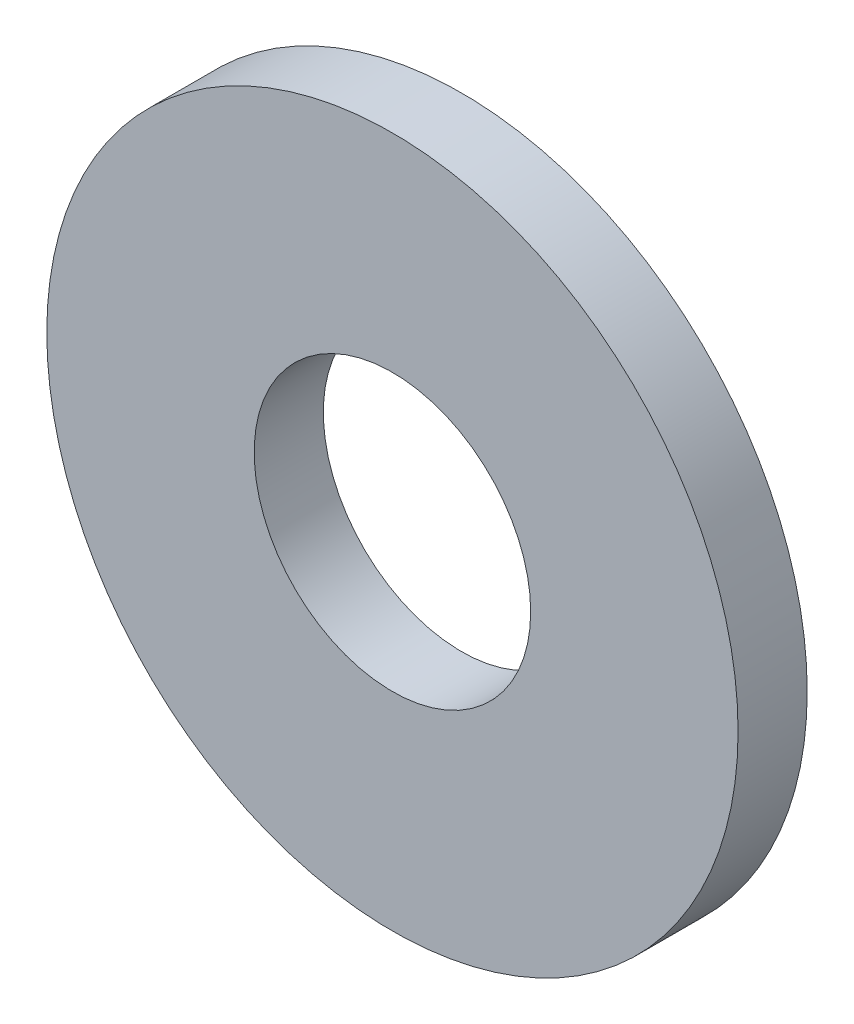
ISO-10303-21;
HEADER;
FILE_DESCRIPTION(('STEP AP214'),'2;1');
FILE_NAME('part.step','',(''),(''),'','','');
FILE_SCHEMA(('AUTOMOTIVE_DESIGN { 1 0 10303 214 1 1 1 1 }'));
ENDSEC;
DATA;
#1=APPLICATION_CONTEXT('core data for automotive mechanical design processes');
#2=APPLICATION_PROTOCOL_DEFINITION('international standard','automotive_design',2000,#1);
#3=PRODUCT_CONTEXT('',#1,'mechanical');
#4=PRODUCT('Part','Part','',(#3));
#5=PRODUCT_RELATED_PRODUCT_CATEGORY('part','',(#4));
#6=PRODUCT_DEFINITION_FORMATION('','',#4);
#7=PRODUCT_DEFINITION_CONTEXT('part definition',#1,'design');
#8=PRODUCT_DEFINITION('design','',#6,#7);
#9=PRODUCT_DEFINITION_SHAPE('','',#8);
#10=(LENGTH_UNIT() NAMED_UNIT(*) SI_UNIT(.MILLI.,.METRE.));
#11=(NAMED_UNIT(*) PLANE_ANGLE_UNIT() SI_UNIT($,.RADIAN.));
#12=(NAMED_UNIT(*) SI_UNIT($,.STERADIAN.) SOLID_ANGLE_UNIT());
#13=UNCERTAINTY_MEASURE_WITH_UNIT(LENGTH_MEASURE(1.E-05),#10,'distance_accuracy_value','');
#14=(GEOMETRIC_REPRESENTATION_CONTEXT(3) GLOBAL_UNCERTAINTY_ASSIGNED_CONTEXT((#13)) GLOBAL_UNIT_ASSIGNED_CONTEXT((#10,
#11,#12)) REPRESENTATION_CONTEXT('',''));
#15=CARTESIAN_POINT('',(0.,0.,0.));
#16=DIRECTION('',(0.,0.,1.));
#17=DIRECTION('',(1.,0.,0.));
#18=AXIS2_PLACEMENT_3D('',#15,#16,#17);
#19=CARTESIAN_POINT('',(0.,0.,0.25));
#20=DIRECTION('',(0.,0.,1.));
#21=DIRECTION('',(1.,0.,0.));
#22=AXIS2_PLACEMENT_3D('',#19,#20,#21);
#23=PLANE('',#22);
#24=CARTESIAN_POINT('',(0.,0.,0.25));
#25=DIRECTION('',(0.,0.,1.));
#26=DIRECTION('',(1.,0.,0.));
#27=AXIS2_PLACEMENT_3D('',#24,#25,#26);
#28=CIRCLE('',#27,2.5);
#29=CARTESIAN_POINT('',(2.5,0.,0.25));
#30=VERTEX_POINT('',#29);
#31=EDGE_CURVE('E10',#30,#30,#28,.T.);
#32=ORIENTED_EDGE('',*,*,#31,.T.);
#33=EDGE_LOOP('',(#32));
#34=FACE_BOUND('',#33,.T.);
#35=CARTESIAN_POINT('',(0.,0.,0.25));
#36=DIRECTION('',(0.,0.,1.));
#37=DIRECTION('',(1.,0.,0.));
#38=AXIS2_PLACEMENT_3D('',#35,#36,#37);
#39=CIRCLE('',#38,1.);
#40=CARTESIAN_POINT('',(1.,0.,0.25));
#41=VERTEX_POINT('',#40);
#42=EDGE_CURVE('E41',#41,#41,#39,.T.);
#43=ORIENTED_EDGE('',*,*,#42,.F.);
#44=EDGE_LOOP('',(#43));
#45=FACE_BOUND('',#44,.T.);
#46=ADVANCED_FACE('F30',(#34,#45),#23,.T.);
#47=CARTESIAN_POINT('',(0.,0.,-0.25));
#48=DIRECTION('',(0.,0.,1.));
#49=DIRECTION('',(1.,0.,0.));
#50=AXIS2_PLACEMENT_3D('',#47,#48,#49);
#51=PLANE('',#50);
#52=CARTESIAN_POINT('',(0.,0.,-0.25));
#53=DIRECTION('',(0.,0.,1.));
#54=DIRECTION('',(1.,0.,0.));
#55=AXIS2_PLACEMENT_3D('',#52,#53,#54);
#56=CIRCLE('',#55,2.5);
#57=CARTESIAN_POINT('',(2.5,0.,-0.25));
#58=VERTEX_POINT('',#57);
#59=EDGE_CURVE('E34',#58,#58,#56,.T.);
#60=ORIENTED_EDGE('',*,*,#59,.F.);
#61=EDGE_LOOP('',(#60));
#62=FACE_BOUND('',#61,.T.);
#63=CARTESIAN_POINT('',(0.,0.,-0.25));
#64=DIRECTION('',(0.,0.,1.));
#65=DIRECTION('',(1.,0.,0.));
#66=AXIS2_PLACEMENT_3D('',#63,#64,#65);
#67=CIRCLE('',#66,1.);
#68=CARTESIAN_POINT('',(1.,0.,-0.25));
#69=VERTEX_POINT('',#68);
#70=EDGE_CURVE('E43',#69,#69,#67,.T.);
#71=ORIENTED_EDGE('',*,*,#70,.T.);
#72=EDGE_LOOP('',(#71));
#73=FACE_BOUND('',#72,.T.);
#74=ADVANCED_FACE('F53',(#62,#73),#51,.F.);
#75=CARTESIAN_POINT('',(0.,0.,0.25));
#76=DIRECTION('',(0.,0.,-1.));
#77=DIRECTION('',(-1.,0.,0.));
#78=AXIS2_PLACEMENT_3D('',#75,#76,#77);
#79=CYLINDRICAL_SURFACE('',#78,2.5);
#80=ORIENTED_EDGE('',*,*,#31,.F.);
#81=EDGE_LOOP('',(#80));
#82=FACE_BOUND('',#81,.T.);
#83=ORIENTED_EDGE('',*,*,#59,.T.);
#84=EDGE_LOOP('',(#83));
#85=FACE_BOUND('',#84,.T.);
#86=ADVANCED_FACE('F32',(#82,#85),#79,.T.);
#87=CARTESIAN_POINT('',(0.,0.,0.25));
#88=DIRECTION('',(0.,0.,-1.));
#89=DIRECTION('',(-1.,0.,0.));
#90=AXIS2_PLACEMENT_3D('',#87,#88,#89);
#91=CYLINDRICAL_SURFACE('',#90,1.);
#92=ORIENTED_EDGE('',*,*,#42,.T.);
#93=EDGE_LOOP('',(#92));
#94=FACE_BOUND('',#93,.T.);
#95=ORIENTED_EDGE('',*,*,#70,.F.);
#96=EDGE_LOOP('',(#95));
#97=FACE_BOUND('',#96,.T.);
#98=ADVANCED_FACE('F49',(#94,#97),#91,.F.);
#99=CLOSED_SHELL('',(#46,#74,#86,#98));
#100=MANIFOLD_SOLID_BREP('B2',#99);
#101=ADVANCED_BREP_SHAPE_REPRESENTATION('',(#18,#100),#14);
#102=SHAPE_DEFINITION_REPRESENTATION(#9,#101);
ENDSEC;
END-ISO-10303-21;
